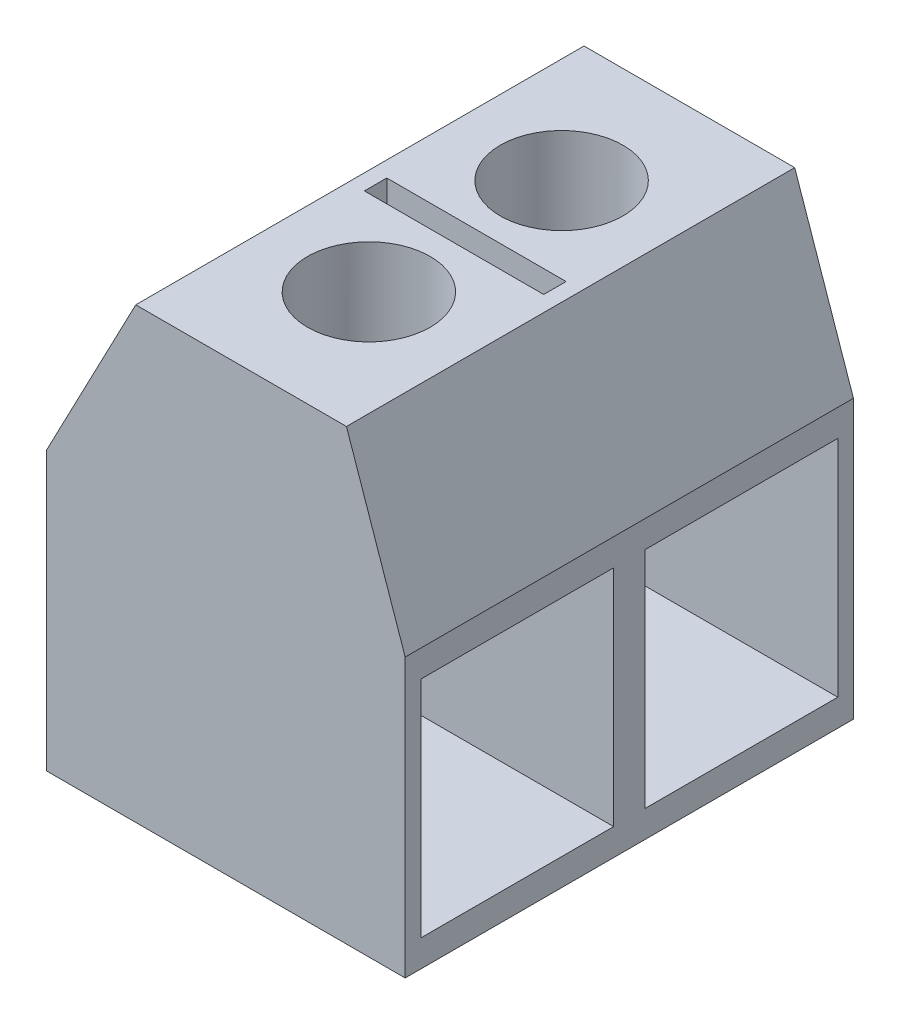
ISO-10303-21;
HEADER;
FILE_DESCRIPTION(('STEP AP214'),'2;1');
FILE_NAME('part.step','',(''),(''),'','','');
FILE_SCHEMA(('AUTOMOTIVE_DESIGN { 1 0 10303 214 1 1 1 1 }'));
ENDSEC;
DATA;
#1=APPLICATION_CONTEXT('core data for automotive mechanical design processes');
#2=APPLICATION_PROTOCOL_DEFINITION('international standard','automotive_design',2000,#1);
#3=PRODUCT_CONTEXT('',#1,'mechanical');
#4=PRODUCT('Part','Part','',(#3));
#5=PRODUCT_RELATED_PRODUCT_CATEGORY('part','',(#4));
#6=PRODUCT_DEFINITION_FORMATION('','',#4);
#7=PRODUCT_DEFINITION_CONTEXT('part definition',#1,'design');
#8=PRODUCT_DEFINITION('design','',#6,#7);
#9=PRODUCT_DEFINITION_SHAPE('','',#8);
#10=(LENGTH_UNIT() NAMED_UNIT(*) SI_UNIT(.MILLI.,.METRE.));
#11=(NAMED_UNIT(*) PLANE_ANGLE_UNIT() SI_UNIT($,.RADIAN.));
#12=(NAMED_UNIT(*) SI_UNIT($,.STERADIAN.) SOLID_ANGLE_UNIT());
#13=UNCERTAINTY_MEASURE_WITH_UNIT(LENGTH_MEASURE(1.E-05),#10,'distance_accuracy_value','');
#14=(GEOMETRIC_REPRESENTATION_CONTEXT(3) GLOBAL_UNCERTAINTY_ASSIGNED_CONTEXT((#13)) GLOBAL_UNIT_ASSIGNED_CONTEXT((#10,
#11,#12)) REPRESENTATION_CONTEXT('',''));
#15=CARTESIAN_POINT('',(0.,0.,0.));
#16=DIRECTION('',(0.,0.,1.));
#17=DIRECTION('',(1.,0.,0.));
#18=AXIS2_PLACEMENT_3D('',#15,#16,#17);
#19=CARTESIAN_POINT('',(-3.41522048364154,6.2,10.));
#20=DIRECTION('',(1.,0.,0.));
#21=DIRECTION('',(0.,1.,0.));
#22=AXIS2_PLACEMENT_3D('',#19,#20,#21);
#23=PLANE('',#22);
#24=DIRECTION('',(0.,-1.,0.));
#25=VECTOR('',#24,1.);
#26=CARTESIAN_POINT('',(-3.41522048364154,6.2,0.));
#27=LINE('',#26,#25);
#28=CARTESIAN_POINT('',(-3.41522048364154,6.2,0.));
#29=VERTEX_POINT('',#28);
#30=CARTESIAN_POINT('',(-3.41522048364153,0.,0.));
#31=VERTEX_POINT('',#30);
#32=EDGE_CURVE('E229',#29,#31,#27,.T.);
#33=ORIENTED_EDGE('',*,*,#32,.T.);
#34=DIRECTION('',(0.,0.,-1.));
#35=VECTOR('',#34,1.);
#36=CARTESIAN_POINT('',(-3.41522048364153,0.,10.));
#37=LINE('',#36,#35);
#38=CARTESIAN_POINT('',(-3.41522048364153,0.,10.));
#39=VERTEX_POINT('',#38);
#40=EDGE_CURVE('E11',#39,#31,#37,.T.);
#41=ORIENTED_EDGE('',*,*,#40,.F.);
#42=DIRECTION('',(0.,-1.,0.));
#43=VECTOR('',#42,1.);
#44=CARTESIAN_POINT('',(-3.41522048364154,6.2,10.));
#45=LINE('',#44,#43);
#46=CARTESIAN_POINT('',(-3.41522048364154,6.2,10.));
#47=VERTEX_POINT('',#46);
#48=EDGE_CURVE('E266',#47,#39,#45,.T.);
#49=ORIENTED_EDGE('',*,*,#48,.F.);
#50=DIRECTION('',(0.,0.,-1.));
#51=VECTOR('',#50,1.);
#52=CARTESIAN_POINT('',(-3.41522048364154,6.2,10.));
#53=LINE('',#52,#51);
#54=EDGE_CURVE('E280',#47,#29,#53,.T.);
#55=ORIENTED_EDGE('',*,*,#54,.T.);
#56=EDGE_LOOP('',(#33,#41,#49,#55));
#57=FACE_BOUND('',#56,.T.);
#58=ADVANCED_FACE('F34',(#57),#23,.F.);
#59=CARTESIAN_POINT('',(-3.41522048364153,0.,10.));
#60=DIRECTION('',(0.,1.,0.));
#61=DIRECTION('',(0.,0.,1.));
#62=AXIS2_PLACEMENT_3D('',#59,#60,#61);
#63=PLANE('',#62);
#64=DIRECTION('',(1.,0.,0.));
#65=VECTOR('',#64,1.);
#66=CARTESIAN_POINT('',(-3.41522048364153,0.,0.));
#67=LINE('',#66,#65);
#68=CARTESIAN_POINT('',(4.58477951635847,0.,0.));
#69=VERTEX_POINT('',#68);
#70=EDGE_CURVE('E283',#31,#69,#67,.T.);
#71=ORIENTED_EDGE('',*,*,#70,.T.);
#72=DIRECTION('',(0.,0.,-1.));
#73=VECTOR('',#72,1.);
#74=CARTESIAN_POINT('',(4.58477951635847,0.,10.));
#75=LINE('',#74,#73);
#76=CARTESIAN_POINT('',(4.58477951635847,0.,10.));
#77=VERTEX_POINT('',#76);
#78=EDGE_CURVE('E42',#77,#69,#75,.T.);
#79=ORIENTED_EDGE('',*,*,#78,.F.);
#80=DIRECTION('',(1.,0.,0.));
#81=VECTOR('',#80,1.);
#82=CARTESIAN_POINT('',(-3.41522048364153,0.,10.));
#83=LINE('',#82,#81);
#84=EDGE_CURVE('E269',#39,#77,#83,.T.);
#85=ORIENTED_EDGE('',*,*,#84,.F.);
#86=ORIENTED_EDGE('',*,*,#40,.T.);
#87=EDGE_LOOP('',(#71,#79,#85,#86));
#88=FACE_BOUND('',#87,.T.);
#89=ADVANCED_FACE('F330',(#88),#63,.F.);
#90=CARTESIAN_POINT('',(4.58477951635847,0.,10.));
#91=DIRECTION('',(-1.,0.,0.));
#92=DIRECTION('',(0.,0.,1.));
#93=AXIS2_PLACEMENT_3D('',#90,#91,#92);
#94=PLANE('',#93);
#95=DIRECTION('',(0.,0.,1.));
#96=VECTOR('',#95,1.);
#97=CARTESIAN_POINT('',(4.58477951635847,5.6,4.65));
#98=LINE('',#97,#96);
#99=CARTESIAN_POINT('',(4.58477951635847,5.6,0.35));
#100=VERTEX_POINT('',#99);
#101=CARTESIAN_POINT('',(4.58477951635847,5.6,4.65));
#102=VERTEX_POINT('',#101);
#103=EDGE_CURVE('E218',#100,#102,#98,.T.);
#104=ORIENTED_EDGE('',*,*,#103,.F.);
#105=DIRECTION('',(0.,1.,0.));
#106=VECTOR('',#105,1.);
#107=CARTESIAN_POINT('',(4.58477951635847,0.599999999999999,0.350000000000001));
#108=LINE('',#107,#106);
#109=CARTESIAN_POINT('',(4.58477951635847,0.599999999999999,0.350000000000001));
#110=VERTEX_POINT('',#109);
#111=EDGE_CURVE('E58',#110,#100,#108,.T.);
#112=ORIENTED_EDGE('',*,*,#111,.F.);
#113=DIRECTION('',(0.,0.,-1.));
#114=VECTOR('',#113,1.);
#115=CARTESIAN_POINT('',(4.58477951635847,0.599999999999999,4.65));
#116=LINE('',#115,#114);
#117=CARTESIAN_POINT('',(4.58477951635847,0.599999999999999,4.65));
#118=VERTEX_POINT('',#117);
#119=EDGE_CURVE('E207',#118,#110,#116,.T.);
#120=ORIENTED_EDGE('',*,*,#119,.F.);
#121=DIRECTION('',(0.,-1.,0.));
#122=VECTOR('',#121,1.);
#123=CARTESIAN_POINT('',(4.58477951635847,0.599999999999999,4.65));
#124=LINE('',#123,#122);
#125=EDGE_CURVE('E222',#102,#118,#124,.T.);
#126=ORIENTED_EDGE('',*,*,#125,.F.);
#127=EDGE_LOOP('',(#104,#112,#120,#126));
#128=FACE_BOUND('',#127,.T.);
#129=DIRECTION('',(0.,0.,1.));
#130=VECTOR('',#129,1.);
#131=CARTESIAN_POINT('',(4.58477951635847,5.6,5.35));
#132=LINE('',#131,#130);
#133=CARTESIAN_POINT('',(4.58477951635847,5.6,5.35));
#134=VERTEX_POINT('',#133);
#135=CARTESIAN_POINT('',(4.58477951635847,5.6,9.65));
#136=VERTEX_POINT('',#135);
#137=EDGE_CURVE('E251',#134,#136,#132,.T.);
#138=ORIENTED_EDGE('',*,*,#137,.F.);
#139=DIRECTION('',(0.,1.,0.));
#140=VECTOR('',#139,1.);
#141=CARTESIAN_POINT('',(4.58477951635847,0.600000000000002,5.35));
#142=LINE('',#141,#140);
#143=CARTESIAN_POINT('',(4.58477951635847,0.600000000000002,5.35));
#144=VERTEX_POINT('',#143);
#145=EDGE_CURVE('E249',#144,#134,#142,.T.);
#146=ORIENTED_EDGE('',*,*,#145,.F.);
#147=DIRECTION('',(0.,0.,-1.));
#148=VECTOR('',#147,1.);
#149=CARTESIAN_POINT('',(4.58477951635847,0.600000000000002,5.35));
#150=LINE('',#149,#148);
#151=CARTESIAN_POINT('',(4.58477951635847,0.600000000000002,9.65));
#152=VERTEX_POINT('',#151);
#153=EDGE_CURVE('E239',#152,#144,#150,.T.);
#154=ORIENTED_EDGE('',*,*,#153,.F.);
#155=DIRECTION('',(0.,-1.,0.));
#156=VECTOR('',#155,1.);
#157=CARTESIAN_POINT('',(4.58477951635847,0.600000000000002,9.65));
#158=LINE('',#157,#156);
#159=EDGE_CURVE('E254',#136,#152,#158,.T.);
#160=ORIENTED_EDGE('',*,*,#159,.F.);
#161=EDGE_LOOP('',(#138,#146,#154,#160));
#162=FACE_BOUND('',#161,.T.);
#163=DIRECTION('',(0.,1.,0.));
#164=VECTOR('',#163,1.);
#165=CARTESIAN_POINT('',(4.58477951635847,0.,0.));
#166=LINE('',#165,#164);
#167=CARTESIAN_POINT('',(4.58477951635847,6.2,0.));
#168=VERTEX_POINT('',#167);
#169=EDGE_CURVE('E285',#69,#168,#166,.T.);
#170=ORIENTED_EDGE('',*,*,#169,.T.);
#171=DIRECTION('',(0.,0.,-1.));
#172=VECTOR('',#171,1.);
#173=CARTESIAN_POINT('',(4.58477951635847,6.2,10.));
#174=LINE('',#173,#172);
#175=CARTESIAN_POINT('',(4.58477951635847,6.2,10.));
#176=VERTEX_POINT('',#175);
#177=EDGE_CURVE('E300',#176,#168,#174,.T.);
#178=ORIENTED_EDGE('',*,*,#177,.F.);
#179=DIRECTION('',(0.,1.,0.));
#180=VECTOR('',#179,1.);
#181=CARTESIAN_POINT('',(4.58477951635847,0.,10.));
#182=LINE('',#181,#180);
#183=EDGE_CURVE('E272',#77,#176,#182,.T.);
#184=ORIENTED_EDGE('',*,*,#183,.F.);
#185=ORIENTED_EDGE('',*,*,#78,.T.);
#186=EDGE_LOOP('',(#170,#178,#184,#185));
#187=FACE_BOUND('',#186,.T.);
#188=ADVANCED_FACE('F335',(#128,#162,#187),#94,.F.);
#189=CARTESIAN_POINT('',(4.58477951635847,6.2,10.));
#190=DIRECTION('',(-0.945410467545081,-0.325881953867028,0.));
#191=DIRECTION('',(0.325881953867028,-0.945410467545081,0.));
#192=AXIS2_PLACEMENT_3D('',#189,#190,#191);
#193=PLANE('',#192);
#194=DIRECTION('',(-0.325881953867028,0.945410467545081,0.));
#195=VECTOR('',#194,1.);
#196=CARTESIAN_POINT('',(4.58477951635847,6.2,0.));
#197=LINE('',#196,#195);
#198=CARTESIAN_POINT('',(3.27473406181301,10.0005500795312,0.));
#199=VERTEX_POINT('',#198);
#200=EDGE_CURVE('E287',#168,#199,#197,.T.);
#201=ORIENTED_EDGE('',*,*,#200,.T.);
#202=DIRECTION('',(0.,0.,-1.));
#203=VECTOR('',#202,1.);
#204=CARTESIAN_POINT('',(3.27473406181301,10.0005500795312,10.));
#205=LINE('',#204,#203);
#206=CARTESIAN_POINT('',(3.27473406181301,10.0005500795312,10.));
#207=VERTEX_POINT('',#206);
#208=EDGE_CURVE('E297',#207,#199,#205,.T.);
#209=ORIENTED_EDGE('',*,*,#208,.F.);
#210=DIRECTION('',(-0.325881953867028,0.945410467545081,0.));
#211=VECTOR('',#210,1.);
#212=CARTESIAN_POINT('',(4.58477951635847,6.2,10.));
#213=LINE('',#212,#211);
#214=EDGE_CURVE('E274',#176,#207,#213,.T.);
#215=ORIENTED_EDGE('',*,*,#214,.F.);
#216=ORIENTED_EDGE('',*,*,#177,.T.);
#217=EDGE_LOOP('',(#201,#209,#215,#216));
#218=FACE_BOUND('',#217,.T.);
#219=ADVANCED_FACE('F360',(#218),#193,.F.);
#220=CARTESIAN_POINT('',(3.27473406181301,10.0005500795312,10.));
#221=DIRECTION('',(0.,-1.,0.));
#222=DIRECTION('',(1.,0.,0.));
#223=AXIS2_PLACEMENT_3D('',#220,#221,#222);
#224=PLANE('',#223);
#225=CARTESIAN_POINT('',(0.924734061813011,10.0005500795312,7.15));
#226=DIRECTION('',(0.,1.,0.));
#227=DIRECTION('',(1.,0.,0.));
#228=AXIS2_PLACEMENT_3D('',#225,#226,#227);
#229=CIRCLE('',#228,1.36868671342724);
#230=CARTESIAN_POINT('',(2.29342077524025,10.0005500795312,7.15));
#231=VERTEX_POINT('',#230);
#232=EDGE_CURVE('E186',#231,#231,#229,.T.);
#233=ORIENTED_EDGE('',*,*,#232,.F.);
#234=EDGE_LOOP('',(#233));
#235=FACE_BOUND('',#234,.T.);
#236=CARTESIAN_POINT('',(0.924734061813011,10.0005500795312,2.85));
#237=DIRECTION('',(0.,1.,0.));
#238=DIRECTION('',(-1.,0.,0.));
#239=AXIS2_PLACEMENT_3D('',#236,#237,#238);
#240=CIRCLE('',#239,1.36868671342724);
#241=CARTESIAN_POINT('',(-0.443952651614231,10.0005500795312,2.85));
#242=VERTEX_POINT('',#241);
#243=EDGE_CURVE('E193',#242,#242,#240,.T.);
#244=ORIENTED_EDGE('',*,*,#243,.F.);
#245=EDGE_LOOP('',(#244));
#246=FACE_BOUND('',#245,.T.);
#247=DIRECTION('',(1.,0.,0.));
#248=VECTOR('',#247,1.);
#249=CARTESIAN_POINT('',(2.92473406181301,10.0005500795312,5.25));
#250=LINE('',#249,#248);
#251=CARTESIAN_POINT('',(-1.07526593818699,10.0005500795312,5.25));
#252=VERTEX_POINT('',#251);
#253=CARTESIAN_POINT('',(2.92473406181301,10.0005500795312,5.25));
#254=VERTEX_POINT('',#253);
#255=EDGE_CURVE('E192',#252,#254,#250,.T.);
#256=ORIENTED_EDGE('',*,*,#255,.F.);
#257=DIRECTION('',(0.,0.,1.));
#258=VECTOR('',#257,1.);
#259=CARTESIAN_POINT('',(-1.07526593818699,10.0005500795312,5.25));
#260=LINE('',#259,#258);
#261=CARTESIAN_POINT('',(-1.07526593818699,10.0005500795312,4.75));
#262=VERTEX_POINT('',#261);
#263=EDGE_CURVE('E50',#262,#252,#260,.T.);
#264=ORIENTED_EDGE('',*,*,#263,.F.);
#265=DIRECTION('',(-1.,0.,0.));
#266=VECTOR('',#265,1.);
#267=CARTESIAN_POINT('',(2.92473406181301,10.0005500795312,4.75));
#268=LINE('',#267,#266);
#269=CARTESIAN_POINT('',(2.92473406181301,10.0005500795312,4.75));
#270=VERTEX_POINT('',#269);
#271=EDGE_CURVE('E180',#270,#262,#268,.T.);
#272=ORIENTED_EDGE('',*,*,#271,.F.);
#273=DIRECTION('',(0.,0.,-1.));
#274=VECTOR('',#273,1.);
#275=CARTESIAN_POINT('',(2.92473406181301,10.0005500795312,5.25));
#276=LINE('',#275,#274);
#277=EDGE_CURVE('E183',#254,#270,#276,.T.);
#278=ORIENTED_EDGE('',*,*,#277,.F.);
#279=EDGE_LOOP('',(#256,#264,#272,#278));
#280=FACE_BOUND('',#279,.T.);
#281=DIRECTION('',(-1.,0.,0.));
#282=VECTOR('',#281,1.);
#283=CARTESIAN_POINT('',(3.27473406181301,10.0005500795312,0.));
#284=LINE('',#283,#282);
#285=CARTESIAN_POINT('',(-1.42526593818699,10.0005500795312,0.));
#286=VERTEX_POINT('',#285);
#287=EDGE_CURVE('E289',#199,#286,#284,.T.);
#288=ORIENTED_EDGE('',*,*,#287,.T.);
#289=DIRECTION('',(0.,0.,-1.));
#290=VECTOR('',#289,1.);
#291=CARTESIAN_POINT('',(-1.42526593818699,10.0005500795312,10.));
#292=LINE('',#291,#290);
#293=CARTESIAN_POINT('',(-1.42526593818699,10.0005500795312,10.));
#294=VERTEX_POINT('',#293);
#295=EDGE_CURVE('E294',#294,#286,#292,.T.);
#296=ORIENTED_EDGE('',*,*,#295,.F.);
#297=DIRECTION('',(-1.,0.,0.));
#298=VECTOR('',#297,1.);
#299=CARTESIAN_POINT('',(3.27473406181301,10.0005500795312,10.));
#300=LINE('',#299,#298);
#301=EDGE_CURVE('E276',#207,#294,#300,.T.);
#302=ORIENTED_EDGE('',*,*,#301,.F.);
#303=ORIENTED_EDGE('',*,*,#208,.T.);
#304=EDGE_LOOP('',(#288,#296,#302,#303));
#305=FACE_BOUND('',#304,.T.);
#306=ADVANCED_FACE('F357',(#235,#246,#280,#305),#224,.F.);
#307=CARTESIAN_POINT('',(-1.42526593818699,10.0005500795312,10.));
#308=DIRECTION('',(0.885909109447838,-0.463858868404323,0.));
#309=DIRECTION('',(0.463858868404323,0.885909109447838,0.));
#310=AXIS2_PLACEMENT_3D('',#307,#308,#309);
#311=PLANE('',#310);
#312=DIRECTION('',(-0.463858868404323,-0.885909109447838,0.));
#313=VECTOR('',#312,1.);
#314=CARTESIAN_POINT('',(-1.42526593818699,10.0005500795312,0.));
#315=LINE('',#314,#313);
#316=EDGE_CURVE('E270',#286,#29,#315,.T.);
#317=ORIENTED_EDGE('',*,*,#316,.T.);
#318=ORIENTED_EDGE('',*,*,#54,.F.);
#319=DIRECTION('',(-0.463858868404323,-0.885909109447838,0.));
#320=VECTOR('',#319,1.);
#321=CARTESIAN_POINT('',(-1.42526593818699,10.0005500795312,10.));
#322=LINE('',#321,#320);
#323=EDGE_CURVE('E278',#294,#47,#322,.T.);
#324=ORIENTED_EDGE('',*,*,#323,.F.);
#325=ORIENTED_EDGE('',*,*,#295,.T.);
#326=EDGE_LOOP('',(#317,#318,#324,#325));
#327=FACE_BOUND('',#326,.T.);
#328=ADVANCED_FACE('F355',(#327),#311,.F.);
#329=CARTESIAN_POINT('',(0.,0.,10.));
#330=DIRECTION('',(0.,0.,1.));
#331=DIRECTION('',(1.,0.,0.));
#332=AXIS2_PLACEMENT_3D('',#329,#330,#331);
#333=PLANE('',#332);
#334=ORIENTED_EDGE('',*,*,#48,.T.);
#335=ORIENTED_EDGE('',*,*,#84,.T.);
#336=ORIENTED_EDGE('',*,*,#183,.T.);
#337=ORIENTED_EDGE('',*,*,#214,.T.);
#338=ORIENTED_EDGE('',*,*,#301,.T.);
#339=ORIENTED_EDGE('',*,*,#323,.T.);
#340=EDGE_LOOP('',(#334,#335,#336,#337,#338,#339));
#341=FACE_BOUND('',#340,.T.);
#342=ADVANCED_FACE('F350',(#341),#333,.T.);
#343=CARTESIAN_POINT('',(0.,0.,0.));
#344=DIRECTION('',(0.,0.,1.));
#345=DIRECTION('',(1.,0.,0.));
#346=AXIS2_PLACEMENT_3D('',#343,#344,#345);
#347=PLANE('',#346);
#348=ORIENTED_EDGE('',*,*,#32,.F.);
#349=ORIENTED_EDGE('',*,*,#316,.F.);
#350=ORIENTED_EDGE('',*,*,#287,.F.);
#351=ORIENTED_EDGE('',*,*,#200,.F.);
#352=ORIENTED_EDGE('',*,*,#169,.F.);
#353=ORIENTED_EDGE('',*,*,#70,.F.);
#354=EDGE_LOOP('',(#348,#349,#350,#351,#352,#353));
#355=FACE_BOUND('',#354,.T.);
#356=ADVANCED_FACE('F343',(#355),#347,.F.);
#357=CARTESIAN_POINT('',(-0.715220483641534,0.600000000000002,5.35));
#358=DIRECTION('',(0.,0.,-1.));
#359=DIRECTION('',(-1.,0.,0.));
#360=AXIS2_PLACEMENT_3D('',#357,#358,#359);
#361=PLANE('',#360);
#362=ORIENTED_EDGE('',*,*,#145,.T.);
#363=DIRECTION('',(1.,0.,0.));
#364=VECTOR('',#363,1.);
#365=CARTESIAN_POINT('',(-0.715220483641534,5.6,5.35));
#366=LINE('',#365,#364);
#367=CARTESIAN_POINT('',(-0.715220483641534,5.6,5.35));
#368=VERTEX_POINT('',#367);
#369=EDGE_CURVE('E248',#368,#134,#366,.T.);
#370=ORIENTED_EDGE('',*,*,#369,.F.);
#371=DIRECTION('',(0.,1.,0.));
#372=VECTOR('',#371,1.);
#373=CARTESIAN_POINT('',(-0.715220483641534,0.600000000000002,5.35));
#374=LINE('',#373,#372);
#375=CARTESIAN_POINT('',(-0.715220483641534,0.600000000000002,5.35));
#376=VERTEX_POINT('',#375);
#377=EDGE_CURVE('E235',#376,#368,#374,.T.);
#378=ORIENTED_EDGE('',*,*,#377,.F.);
#379=DIRECTION('',(1.,0.,0.));
#380=VECTOR('',#379,1.);
#381=CARTESIAN_POINT('',(-0.715220483641534,0.600000000000002,5.35));
#382=LINE('',#381,#380);
#383=EDGE_CURVE('E219',#376,#144,#382,.T.);
#384=ORIENTED_EDGE('',*,*,#383,.T.);
#385=EDGE_LOOP('',(#362,#370,#378,#384));
#386=FACE_BOUND('',#385,.T.);
#387=ADVANCED_FACE('F381',(#386),#361,.F.);
#388=CARTESIAN_POINT('',(-0.715220483641534,0.600000000000002,5.35));
#389=DIRECTION('',(0.,-1.,0.));
#390=DIRECTION('',(0.,0.,-1.));
#391=AXIS2_PLACEMENT_3D('',#388,#389,#390);
#392=PLANE('',#391);
#393=ORIENTED_EDGE('',*,*,#153,.T.);
#394=ORIENTED_EDGE('',*,*,#383,.F.);
#395=DIRECTION('',(0.,0.,-1.));
#396=VECTOR('',#395,1.);
#397=CARTESIAN_POINT('',(-0.715220483641534,0.600000000000002,5.35));
#398=LINE('',#397,#396);
#399=CARTESIAN_POINT('',(-0.715220483641534,0.600000000000002,9.65));
#400=VERTEX_POINT('',#399);
#401=EDGE_CURVE('E245',#400,#376,#398,.T.);
#402=ORIENTED_EDGE('',*,*,#401,.F.);
#403=DIRECTION('',(1.,0.,0.));
#404=VECTOR('',#403,1.);
#405=CARTESIAN_POINT('',(-0.715220483641534,0.600000000000002,9.65));
#406=LINE('',#405,#404);
#407=EDGE_CURVE('E260',#400,#152,#406,.T.);
#408=ORIENTED_EDGE('',*,*,#407,.T.);
#409=EDGE_LOOP('',(#393,#394,#402,#408));
#410=FACE_BOUND('',#409,.T.);
#411=ADVANCED_FACE('F386',(#410),#392,.F.);
#412=CARTESIAN_POINT('',(-0.715220483641534,0.600000000000002,9.65));
#413=DIRECTION('',(0.,0.,1.));
#414=DIRECTION('',(1.,0.,0.));
#415=AXIS2_PLACEMENT_3D('',#412,#413,#414);
#416=PLANE('',#415);
#417=ORIENTED_EDGE('',*,*,#159,.T.);
#418=ORIENTED_EDGE('',*,*,#407,.F.);
#419=DIRECTION('',(0.,-1.,0.));
#420=VECTOR('',#419,1.);
#421=CARTESIAN_POINT('',(-0.715220483641534,0.600000000000002,9.65));
#422=LINE('',#421,#420);
#423=CARTESIAN_POINT('',(-0.715220483641534,5.6,9.65));
#424=VERTEX_POINT('',#423);
#425=EDGE_CURVE('E242',#424,#400,#422,.T.);
#426=ORIENTED_EDGE('',*,*,#425,.F.);
#427=DIRECTION('',(1.,0.,0.));
#428=VECTOR('',#427,1.);
#429=CARTESIAN_POINT('',(-0.715220483641534,5.6,9.65));
#430=LINE('',#429,#428);
#431=EDGE_CURVE('E262',#424,#136,#430,.T.);
#432=ORIENTED_EDGE('',*,*,#431,.T.);
#433=EDGE_LOOP('',(#417,#418,#426,#432));
#434=FACE_BOUND('',#433,.T.);
#435=ADVANCED_FACE('F391',(#434),#416,.F.);
#436=CARTESIAN_POINT('',(-0.715220483641534,5.6,5.35));
#437=DIRECTION('',(0.,1.,0.));
#438=DIRECTION('',(0.,0.,1.));
#439=AXIS2_PLACEMENT_3D('',#436,#437,#438);
#440=PLANE('',#439);
#441=CARTESIAN_POINT('',(0.924734061813015,5.6,7.15));
#442=DIRECTION('',(0.,1.,0.));
#443=DIRECTION('',(0.,0.,1.));
#444=AXIS2_PLACEMENT_3D('',#441,#442,#443);
#445=CIRCLE('',#444,1.36868671342724);
#446=CARTESIAN_POINT('',(0.924734061813015,5.6,8.51868671342724));
#447=VERTEX_POINT('',#446);
#448=EDGE_CURVE('E37',#447,#447,#445,.T.);
#449=ORIENTED_EDGE('',*,*,#448,.T.);
#450=EDGE_LOOP('',(#449));
#451=FACE_BOUND('',#450,.T.);
#452=ORIENTED_EDGE('',*,*,#137,.T.);
#453=ORIENTED_EDGE('',*,*,#431,.F.);
#454=DIRECTION('',(0.,0.,1.));
#455=VECTOR('',#454,1.);
#456=CARTESIAN_POINT('',(-0.715220483641534,5.6,5.35));
#457=LINE('',#456,#455);
#458=EDGE_CURVE('E238',#368,#424,#457,.T.);
#459=ORIENTED_EDGE('',*,*,#458,.F.);
#460=ORIENTED_EDGE('',*,*,#369,.T.);
#461=EDGE_LOOP('',(#452,#453,#459,#460));
#462=FACE_BOUND('',#461,.T.);
#463=ADVANCED_FACE('F310',(#451,#462),#440,.F.);
#464=CARTESIAN_POINT('',(-0.715220483641534,0.,0.));
#465=DIRECTION('',(1.,0.,0.));
#466=DIRECTION('',(0.,0.,-1.));
#467=AXIS2_PLACEMENT_3D('',#464,#465,#466);
#468=PLANE('',#467);
#469=ORIENTED_EDGE('',*,*,#377,.T.);
#470=ORIENTED_EDGE('',*,*,#458,.T.);
#471=ORIENTED_EDGE('',*,*,#425,.T.);
#472=ORIENTED_EDGE('',*,*,#401,.T.);
#473=EDGE_LOOP('',(#469,#470,#471,#472));
#474=FACE_BOUND('',#473,.T.);
#475=ADVANCED_FACE('F390',(#474),#468,.T.);
#476=CARTESIAN_POINT('',(-0.715220483641534,0.599999999999999,0.350000000000001));
#477=DIRECTION('',(0.,0.,-1.));
#478=DIRECTION('',(-1.,0.,0.));
#479=AXIS2_PLACEMENT_3D('',#476,#477,#478);
#480=PLANE('',#479);
#481=ORIENTED_EDGE('',*,*,#111,.T.);
#482=DIRECTION('',(1.,0.,0.));
#483=VECTOR('',#482,1.);
#484=CARTESIAN_POINT('',(-0.715220483641534,5.6,0.350000000000001));
#485=LINE('',#484,#483);
#486=CARTESIAN_POINT('',(-0.715220483641534,5.6,0.350000000000001));
#487=VERTEX_POINT('',#486);
#488=EDGE_CURVE('E216',#487,#100,#485,.T.);
#489=ORIENTED_EDGE('',*,*,#488,.F.);
#490=DIRECTION('',(0.,1.,0.));
#491=VECTOR('',#490,1.);
#492=CARTESIAN_POINT('',(-0.715220483641534,0.599999999999999,0.350000000000001));
#493=LINE('',#492,#491);
#494=CARTESIAN_POINT('',(-0.715220483641534,0.599999999999999,0.350000000000001));
#495=VERTEX_POINT('',#494);
#496=EDGE_CURVE('E203',#495,#487,#493,.T.);
#497=ORIENTED_EDGE('',*,*,#496,.F.);
#498=DIRECTION('',(1.,0.,0.));
#499=VECTOR('',#498,1.);
#500=CARTESIAN_POINT('',(-0.715220483641534,0.599999999999999,0.350000000000001));
#501=LINE('',#500,#499);
#502=EDGE_CURVE('E227',#495,#110,#501,.T.);
#503=ORIENTED_EDGE('',*,*,#502,.T.);
#504=EDGE_LOOP('',(#481,#489,#497,#503));
#505=FACE_BOUND('',#504,.T.);
#506=ADVANCED_FACE('F400',(#505),#480,.F.);
#507=CARTESIAN_POINT('',(-0.715220483641534,0.599999999999999,4.65));
#508=DIRECTION('',(0.,-1.,0.));
#509=DIRECTION('',(0.,0.,-1.));
#510=AXIS2_PLACEMENT_3D('',#507,#508,#509);
#511=PLANE('',#510);
#512=ORIENTED_EDGE('',*,*,#119,.T.);
#513=ORIENTED_EDGE('',*,*,#502,.F.);
#514=DIRECTION('',(0.,0.,-1.));
#515=VECTOR('',#514,1.);
#516=CARTESIAN_POINT('',(-0.715220483641534,0.599999999999999,4.65));
#517=LINE('',#516,#515);
#518=CARTESIAN_POINT('',(-0.715220483641534,0.599999999999999,4.65));
#519=VERTEX_POINT('',#518);
#520=EDGE_CURVE('E213',#519,#495,#517,.T.);
#521=ORIENTED_EDGE('',*,*,#520,.F.);
#522=DIRECTION('',(1.,0.,0.));
#523=VECTOR('',#522,1.);
#524=CARTESIAN_POINT('',(-0.715220483641534,0.599999999999999,4.65));
#525=LINE('',#524,#523);
#526=EDGE_CURVE('E230',#519,#118,#525,.T.);
#527=ORIENTED_EDGE('',*,*,#526,.T.);
#528=EDGE_LOOP('',(#512,#513,#521,#527));
#529=FACE_BOUND('',#528,.T.);
#530=ADVANCED_FACE('F404',(#529),#511,.F.);
#531=CARTESIAN_POINT('',(-0.715220483641534,0.599999999999999,4.65));
#532=DIRECTION('',(0.,0.,1.));
#533=DIRECTION('',(1.,0.,0.));
#534=AXIS2_PLACEMENT_3D('',#531,#532,#533);
#535=PLANE('',#534);
#536=ORIENTED_EDGE('',*,*,#125,.T.);
#537=ORIENTED_EDGE('',*,*,#526,.F.);
#538=DIRECTION('',(0.,-1.,0.));
#539=VECTOR('',#538,1.);
#540=CARTESIAN_POINT('',(-0.715220483641534,0.599999999999999,4.65));
#541=LINE('',#540,#539);
#542=CARTESIAN_POINT('',(-0.715220483641534,5.6,4.65));
#543=VERTEX_POINT('',#542);
#544=EDGE_CURVE('E210',#543,#519,#541,.T.);
#545=ORIENTED_EDGE('',*,*,#544,.F.);
#546=DIRECTION('',(1.,0.,0.));
#547=VECTOR('',#546,1.);
#548=CARTESIAN_POINT('',(-0.715220483641534,5.6,4.65));
#549=LINE('',#548,#547);
#550=EDGE_CURVE('E232',#543,#102,#549,.T.);
#551=ORIENTED_EDGE('',*,*,#550,.T.);
#552=EDGE_LOOP('',(#536,#537,#545,#551));
#553=FACE_BOUND('',#552,.T.);
#554=ADVANCED_FACE('F408',(#553),#535,.F.);
#555=CARTESIAN_POINT('',(-0.715220483641534,5.6,4.65));
#556=DIRECTION('',(0.,1.,0.));
#557=DIRECTION('',(0.,0.,1.));
#558=AXIS2_PLACEMENT_3D('',#555,#556,#557);
#559=PLANE('',#558);
#560=CARTESIAN_POINT('',(0.924734061813015,5.6,2.85));
#561=DIRECTION('',(0.,1.,0.));
#562=DIRECTION('',(0.,0.,1.));
#563=AXIS2_PLACEMENT_3D('',#560,#561,#562);
#564=CIRCLE('',#563,1.36868671342724);
#565=CARTESIAN_POINT('',(0.924734061813015,5.6,4.21868671342724));
#566=VERTEX_POINT('',#565);
#567=EDGE_CURVE('E199',#566,#566,#564,.T.);
#568=ORIENTED_EDGE('',*,*,#567,.T.);
#569=EDGE_LOOP('',(#568));
#570=FACE_BOUND('',#569,.T.);
#571=ORIENTED_EDGE('',*,*,#103,.T.);
#572=ORIENTED_EDGE('',*,*,#550,.F.);
#573=DIRECTION('',(0.,0.,1.));
#574=VECTOR('',#573,1.);
#575=CARTESIAN_POINT('',(-0.715220483641534,5.6,4.65));
#576=LINE('',#575,#574);
#577=EDGE_CURVE('E206',#487,#543,#576,.T.);
#578=ORIENTED_EDGE('',*,*,#577,.F.);
#579=ORIENTED_EDGE('',*,*,#488,.T.);
#580=EDGE_LOOP('',(#571,#572,#578,#579));
#581=FACE_BOUND('',#580,.T.);
#582=ADVANCED_FACE('F405',(#570,#581),#559,.F.);
#583=CARTESIAN_POINT('',(-0.715220483641534,0.,0.));
#584=DIRECTION('',(-1.,0.,0.));
#585=DIRECTION('',(0.,0.,1.));
#586=AXIS2_PLACEMENT_3D('',#583,#584,#585);
#587=PLANE('',#586);
#588=ORIENTED_EDGE('',*,*,#496,.T.);
#589=ORIENTED_EDGE('',*,*,#577,.T.);
#590=ORIENTED_EDGE('',*,*,#544,.T.);
#591=ORIENTED_EDGE('',*,*,#520,.T.);
#592=EDGE_LOOP('',(#588,#589,#590,#591));
#593=FACE_BOUND('',#592,.T.);
#594=ADVANCED_FACE('F324',(#593),#587,.F.);
#595=CARTESIAN_POINT('',(0.924734061813015,5.00055007953122,2.85));
#596=DIRECTION('',(0.,1.,0.));
#597=DIRECTION('',(-1.,0.,0.));
#598=AXIS2_PLACEMENT_3D('',#595,#596,#597);
#599=CYLINDRICAL_SURFACE('',#598,1.36868671342724);
#600=ORIENTED_EDGE('',*,*,#243,.T.);
#601=EDGE_LOOP('',(#600));
#602=FACE_BOUND('',#601,.T.);
#603=ORIENTED_EDGE('',*,*,#567,.F.);
#604=EDGE_LOOP('',(#603));
#605=FACE_BOUND('',#604,.T.);
#606=ADVANCED_FACE('F315',(#602,#605),#599,.F.);
#607=CARTESIAN_POINT('',(0.924734061813015,5.00055007953122,7.15));
#608=DIRECTION('',(0.,1.,0.));
#609=DIRECTION('',(-1.,0.,0.));
#610=AXIS2_PLACEMENT_3D('',#607,#608,#609);
#611=CYLINDRICAL_SURFACE('',#610,1.36868671342724);
#612=ORIENTED_EDGE('',*,*,#232,.T.);
#613=EDGE_LOOP('',(#612));
#614=FACE_BOUND('',#613,.T.);
#615=ORIENTED_EDGE('',*,*,#448,.F.);
#616=EDGE_LOOP('',(#615));
#617=FACE_BOUND('',#616,.T.);
#618=ADVANCED_FACE('F313',(#614,#617),#611,.F.);
#619=CARTESIAN_POINT('',(-1.07526593818699,5.00055007953122,5.25));
#620=DIRECTION('',(-1.,0.,0.));
#621=DIRECTION('',(0.,-1.,0.));
#622=AXIS2_PLACEMENT_3D('',#619,#620,#621);
#623=PLANE('',#622);
#624=ORIENTED_EDGE('',*,*,#263,.T.);
#625=DIRECTION('',(0.,1.,0.));
#626=VECTOR('',#625,1.);
#627=CARTESIAN_POINT('',(-1.07526593818699,5.00055007953122,5.25));
#628=LINE('',#627,#626);
#629=CARTESIAN_POINT('',(-1.07526593818699,5.00055007953122,5.25));
#630=VERTEX_POINT('',#629);
#631=EDGE_CURVE('E158',#630,#252,#628,.T.);
#632=ORIENTED_EDGE('',*,*,#631,.F.);
#633=DIRECTION('',(0.,0.,1.));
#634=VECTOR('',#633,1.);
#635=CARTESIAN_POINT('',(-1.07526593818699,5.00055007953122,5.25));
#636=LINE('',#635,#634);
#637=CARTESIAN_POINT('',(-1.07526593818699,5.00055007953122,4.75));
#638=VERTEX_POINT('',#637);
#639=EDGE_CURVE('E162',#638,#630,#636,.T.);
#640=ORIENTED_EDGE('',*,*,#639,.F.);
#641=DIRECTION('',(0.,1.,0.));
#642=VECTOR('',#641,1.);
#643=CARTESIAN_POINT('',(-1.07526593818699,5.00055007953122,4.75));
#644=LINE('',#643,#642);
#645=EDGE_CURVE('E197',#638,#262,#644,.T.);
#646=ORIENTED_EDGE('',*,*,#645,.T.);
#647=EDGE_LOOP('',(#624,#632,#640,#646));
#648=FACE_BOUND('',#647,.T.);
#649=ADVANCED_FACE('F160',(#648),#623,.F.);
#650=CARTESIAN_POINT('',(2.92473406181301,5.00055007953123,4.75));
#651=DIRECTION('',(0.,0.,-1.));
#652=DIRECTION('',(-1.,0.,0.));
#653=AXIS2_PLACEMENT_3D('',#650,#651,#652);
#654=PLANE('',#653);
#655=ORIENTED_EDGE('',*,*,#271,.T.);
#656=ORIENTED_EDGE('',*,*,#645,.F.);
#657=DIRECTION('',(-1.,0.,0.));
#658=VECTOR('',#657,1.);
#659=CARTESIAN_POINT('',(2.92473406181301,5.00055007953123,4.75));
#660=LINE('',#659,#658);
#661=CARTESIAN_POINT('',(2.92473406181301,5.00055007953123,4.75));
#662=VERTEX_POINT('',#661);
#663=EDGE_CURVE('E168',#662,#638,#660,.T.);
#664=ORIENTED_EDGE('',*,*,#663,.F.);
#665=DIRECTION('',(0.,1.,0.));
#666=VECTOR('',#665,1.);
#667=CARTESIAN_POINT('',(2.92473406181301,5.00055007953123,4.75));
#668=LINE('',#667,#666);
#669=EDGE_CURVE('E200',#662,#270,#668,.T.);
#670=ORIENTED_EDGE('',*,*,#669,.T.);
#671=EDGE_LOOP('',(#655,#656,#664,#670));
#672=FACE_BOUND('',#671,.T.);
#673=ADVANCED_FACE('F322',(#672),#654,.F.);
#674=CARTESIAN_POINT('',(2.92473406181301,5.00055007953123,5.25));
#675=DIRECTION('',(1.,0.,0.));
#676=DIRECTION('',(0.,1.,0.));
#677=AXIS2_PLACEMENT_3D('',#674,#675,#676);
#678=PLANE('',#677);
#679=ORIENTED_EDGE('',*,*,#277,.T.);
#680=ORIENTED_EDGE('',*,*,#669,.F.);
#681=DIRECTION('',(0.,0.,-1.));
#682=VECTOR('',#681,1.);
#683=CARTESIAN_POINT('',(2.92473406181301,5.00055007953123,5.25));
#684=LINE('',#683,#682);
#685=CARTESIAN_POINT('',(2.92473406181301,5.00055007953123,5.25));
#686=VERTEX_POINT('',#685);
#687=EDGE_CURVE('E176',#686,#662,#684,.T.);
#688=ORIENTED_EDGE('',*,*,#687,.F.);
#689=DIRECTION('',(0.,1.,0.));
#690=VECTOR('',#689,1.);
#691=CARTESIAN_POINT('',(2.92473406181301,5.00055007953123,5.25));
#692=LINE('',#691,#690);
#693=EDGE_CURVE('E167',#686,#254,#692,.T.);
#694=ORIENTED_EDGE('',*,*,#693,.T.);
#695=EDGE_LOOP('',(#679,#680,#688,#694));
#696=FACE_BOUND('',#695,.T.);
#697=ADVANCED_FACE('F420',(#696),#678,.F.);
#698=CARTESIAN_POINT('',(2.92473406181301,5.00055007953123,5.25));
#699=DIRECTION('',(0.,0.,1.));
#700=DIRECTION('',(1.,0.,0.));
#701=AXIS2_PLACEMENT_3D('',#698,#699,#700);
#702=PLANE('',#701);
#703=ORIENTED_EDGE('',*,*,#255,.T.);
#704=ORIENTED_EDGE('',*,*,#693,.F.);
#705=DIRECTION('',(1.,0.,0.));
#706=VECTOR('',#705,1.);
#707=CARTESIAN_POINT('',(2.92473406181301,5.00055007953123,5.25));
#708=LINE('',#707,#706);
#709=EDGE_CURVE('E171',#630,#686,#708,.T.);
#710=ORIENTED_EDGE('',*,*,#709,.F.);
#711=ORIENTED_EDGE('',*,*,#631,.T.);
#712=EDGE_LOOP('',(#703,#704,#710,#711));
#713=FACE_BOUND('',#712,.T.);
#714=ADVANCED_FACE('F172',(#713),#702,.F.);
#715=CARTESIAN_POINT('',(0.,5.00055007953122,0.));
#716=DIRECTION('',(0.,1.,0.));
#717=DIRECTION('',(-1.,0.,0.));
#718=AXIS2_PLACEMENT_3D('',#715,#716,#717);
#719=PLANE('',#718);
#720=ORIENTED_EDGE('',*,*,#639,.T.);
#721=ORIENTED_EDGE('',*,*,#709,.T.);
#722=ORIENTED_EDGE('',*,*,#687,.T.);
#723=ORIENTED_EDGE('',*,*,#663,.T.);
#724=EDGE_LOOP('',(#720,#721,#722,#723));
#725=FACE_BOUND('',#724,.T.);
#726=ADVANCED_FACE('F178',(#725),#719,.T.);
#727=CLOSED_SHELL('',(#58,#89,#188,#219,#306,#328,#342,#356,#387,#411,#435,#463,#475,#506,#530,
#554,#582,#594,#606,#618,#649,#673,#697,#714,#726));
#728=MANIFOLD_SOLID_BREP('B2',#727);
#729=ADVANCED_BREP_SHAPE_REPRESENTATION('',(#18,#728),#14);
#730=SHAPE_DEFINITION_REPRESENTATION(#9,#729);
ENDSEC;
END-ISO-10303-21;
